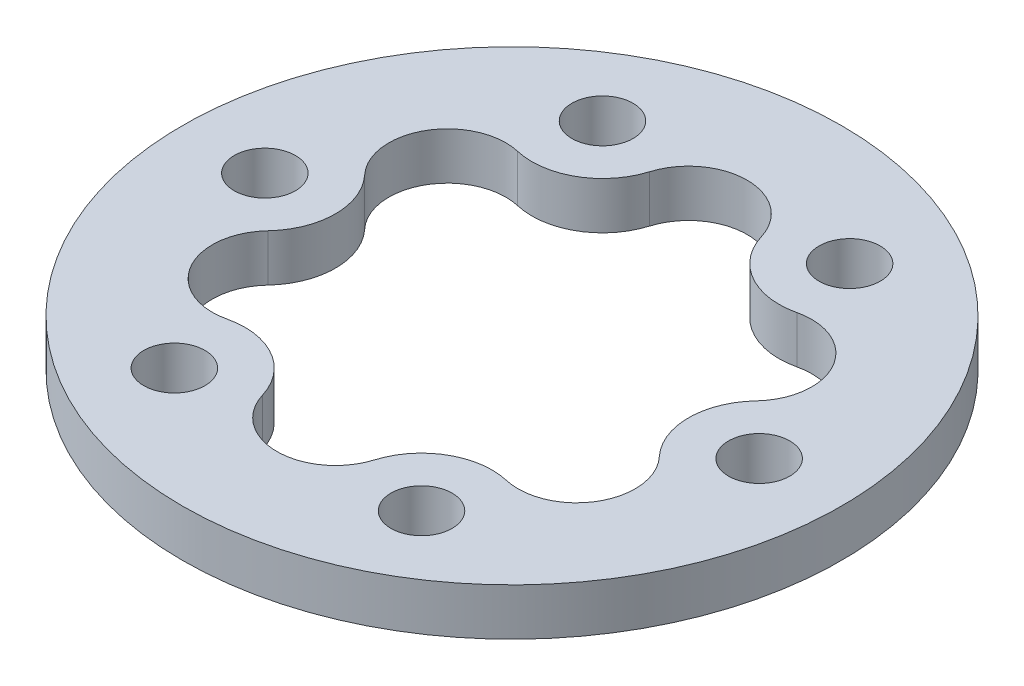
ISO-10303-21;
HEADER;
FILE_DESCRIPTION(('STEP AP214'),'2;1');
FILE_NAME('part.step','',(''),(''),'','','');
FILE_SCHEMA(('AUTOMOTIVE_DESIGN { 1 0 10303 214 1 1 1 1 }'));
ENDSEC;
DATA;
#1=APPLICATION_CONTEXT('core data for automotive mechanical design processes');
#2=APPLICATION_PROTOCOL_DEFINITION('international standard','automotive_design',2000,#1);
#3=PRODUCT_CONTEXT('',#1,'mechanical');
#4=PRODUCT('Part','Part','',(#3));
#5=PRODUCT_RELATED_PRODUCT_CATEGORY('part','',(#4));
#6=PRODUCT_DEFINITION_FORMATION('','',#4);
#7=PRODUCT_DEFINITION_CONTEXT('part definition',#1,'design');
#8=PRODUCT_DEFINITION('design','',#6,#7);
#9=PRODUCT_DEFINITION_SHAPE('','',#8);
#10=(LENGTH_UNIT() NAMED_UNIT(*) SI_UNIT(.MILLI.,.METRE.));
#11=(NAMED_UNIT(*) PLANE_ANGLE_UNIT() SI_UNIT($,.RADIAN.));
#12=(NAMED_UNIT(*) SI_UNIT($,.STERADIAN.) SOLID_ANGLE_UNIT());
#13=UNCERTAINTY_MEASURE_WITH_UNIT(LENGTH_MEASURE(1.E-05),#10,'distance_accuracy_value','');
#14=(GEOMETRIC_REPRESENTATION_CONTEXT(3) GLOBAL_UNCERTAINTY_ASSIGNED_CONTEXT((#13)) GLOBAL_UNIT_ASSIGNED_CONTEXT((#10,
#11,#12)) REPRESENTATION_CONTEXT('',''));
#15=CARTESIAN_POINT('',(0.,0.,0.));
#16=DIRECTION('',(0.,0.,1.));
#17=DIRECTION('',(1.,0.,0.));
#18=AXIS2_PLACEMENT_3D('',#15,#16,#17);
#19=CARTESIAN_POINT('',(0.,4.,0.));
#20=DIRECTION('',(0.,1.,0.));
#21=DIRECTION('',(0.,0.,1.));
#22=AXIS2_PLACEMENT_3D('',#19,#20,#21);
#23=PLANE('',#22);
#24=CARTESIAN_POINT('',(-10.5000000000001,4.,-18.1865334794733));
#25=DIRECTION('',(0.,1.,0.));
#26=DIRECTION('',(0.,0.,1.));
#27=AXIS2_PLACEMENT_3D('',#24,#25,#26);
#28=CIRCLE('',#27,2.6);
#29=CARTESIAN_POINT('',(-10.5000000000001,4.,-15.5865334794733));
#30=VERTEX_POINT('',#29);
#31=EDGE_CURVE('E225',#30,#30,#28,.T.);
#32=ORIENTED_EDGE('',*,*,#31,.F.);
#33=EDGE_LOOP('',(#32));
#34=FACE_BOUND('',#33,.T.);
#35=CARTESIAN_POINT('',(-10.5000000000001,4.,18.1865334794731));
#36=DIRECTION('',(0.,1.,0.));
#37=DIRECTION('',(0.,0.,1.));
#38=AXIS2_PLACEMENT_3D('',#35,#36,#37);
#39=CIRCLE('',#38,2.6);
#40=CARTESIAN_POINT('',(-10.5000000000001,4.,20.7865334794731));
#41=VERTEX_POINT('',#40);
#42=EDGE_CURVE('E237',#41,#41,#39,.T.);
#43=ORIENTED_EDGE('',*,*,#42,.F.);
#44=EDGE_LOOP('',(#43));
#45=FACE_BOUND('',#44,.T.);
#46=CARTESIAN_POINT('',(20.9999999999999,4.,0.));
#47=DIRECTION('',(0.,1.,0.));
#48=DIRECTION('',(0.,0.,1.));
#49=AXIS2_PLACEMENT_3D('',#46,#47,#48);
#50=CIRCLE('',#49,2.6);
#51=CARTESIAN_POINT('',(20.9999999999999,4.,2.59999999999992));
#52=VERTEX_POINT('',#51);
#53=EDGE_CURVE('E249',#52,#52,#50,.T.);
#54=ORIENTED_EDGE('',*,*,#53,.F.);
#55=EDGE_LOOP('',(#54));
#56=FACE_BOUND('',#55,.T.);
#57=CARTESIAN_POINT('',(0.,4.,0.));
#58=DIRECTION('',(0.,1.,0.));
#59=DIRECTION('',(0.,0.,1.));
#60=AXIS2_PLACEMENT_3D('',#57,#58,#59);
#61=CIRCLE('',#60,28.);
#62=CARTESIAN_POINT('',(0.,4.,28.));
#63=VERTEX_POINT('',#62);
#64=EDGE_CURVE('E11',#63,#63,#61,.T.);
#65=ORIENTED_EDGE('',*,*,#64,.T.);
#66=EDGE_LOOP('',(#65));
#67=FACE_BOUND('',#66,.T.);
#68=CARTESIAN_POINT('',(10.4999999999999,4.,-18.1865334794733));
#69=DIRECTION('',(0.,1.,0.));
#70=DIRECTION('',(0.,0.,1.));
#71=AXIS2_PLACEMENT_3D('',#68,#69,#70);
#72=CIRCLE('',#71,2.6);
#73=CARTESIAN_POINT('',(10.4999999999999,4.,-15.5865334794733));
#74=VERTEX_POINT('',#73);
#75=EDGE_CURVE('E255',#74,#74,#72,.T.);
#76=ORIENTED_EDGE('',*,*,#75,.F.);
#77=EDGE_LOOP('',(#76));
#78=FACE_BOUND('',#77,.T.);
#79=CARTESIAN_POINT('',(10.4999999999999,4.,18.1865334794731));
#80=DIRECTION('',(0.,1.,0.));
#81=DIRECTION('',(0.,0.,1.));
#82=AXIS2_PLACEMENT_3D('',#79,#80,#81);
#83=CIRCLE('',#82,2.6);
#84=CARTESIAN_POINT('',(10.4999999999999,4.,20.7865334794731));
#85=VERTEX_POINT('',#84);
#86=EDGE_CURVE('E243',#85,#85,#83,.T.);
#87=ORIENTED_EDGE('',*,*,#86,.F.);
#88=EDGE_LOOP('',(#87));
#89=FACE_BOUND('',#88,.T.);
#90=CARTESIAN_POINT('',(-21.,4.,1.2805208282618E-13));
#91=DIRECTION('',(0.,1.,0.));
#92=DIRECTION('',(0.,0.,1.));
#93=AXIS2_PLACEMENT_3D('',#90,#91,#92);
#94=CIRCLE('',#93,2.6);
#95=CARTESIAN_POINT('',(-21.,4.,2.60000000000013));
#96=VERTEX_POINT('',#95);
#97=EDGE_CURVE('E231',#96,#96,#94,.T.);
#98=ORIENTED_EDGE('',*,*,#97,.F.);
#99=EDGE_LOOP('',(#98));
#100=FACE_BOUND('',#99,.T.);
#101=CARTESIAN_POINT('',(0.,4.,-15.));
#102=DIRECTION('',(0.,1.,0.));
#103=DIRECTION('',(0.,0.,1.));
#104=AXIS2_PLACEMENT_3D('',#101,#102,#103);
#105=CIRCLE('',#104,4.97287544884216);
#106=CARTESIAN_POINT('',(4.75856966173357,4.,-16.444127765859));
#107=VERTEX_POINT('',#106);
#108=CARTESIAN_POINT('',(-4.7585696630104,4.,-16.444127761652));
#109=VERTEX_POINT('',#108);
#110=EDGE_CURVE('E131',#107,#109,#105,.T.);
#111=ORIENTED_EDGE('',*,*,#110,.F.);
#112=CARTESIAN_POINT('',(10.4999999999999,4.,-18.1865334794733));
#113=DIRECTION('',(0.,1.,0.));
#114=DIRECTION('',(0.,0.,1.));
#115=AXIS2_PLACEMENT_3D('',#112,#113,#114);
#116=CIRCLE('',#115,6.00000000000005);
#117=CARTESIAN_POINT('',(11.8617475531622,4.,-12.343106094671));
#118=VERTEX_POINT('',#117);
#119=EDGE_CURVE('E221',#118,#107,#116,.F.);
#120=ORIENTED_EDGE('',*,*,#119,.F.);
#121=CARTESIAN_POINT('',(12.9903810567666,4.,-7.49999999999997));
#122=DIRECTION('',(0.,1.,0.));
#123=DIRECTION('',(0.,0.,1.));
#124=AXIS2_PLACEMENT_3D('',#121,#122,#123);
#125=CIRCLE('',#124,4.97287544884213);
#126=CARTESIAN_POINT('',(16.6203172191777,4.,-4.10102167019017));
#127=VERTEX_POINT('',#126);
#128=EDGE_CURVE('E219',#127,#118,#125,.T.);
#129=ORIENTED_EDGE('',*,*,#128,.F.);
#130=CARTESIAN_POINT('',(21.,4.,0.));
#131=DIRECTION('',(0.,1.,0.));
#132=DIRECTION('',(0.,0.,1.));
#133=AXIS2_PLACEMENT_3D('',#130,#131,#132);
#134=CIRCLE('',#133,6.00000000000013);
#135=CARTESIAN_POINT('',(16.6203172161726,4.,4.10102166698093));
#136=VERTEX_POINT('',#135);
#137=EDGE_CURVE('E217',#136,#127,#134,.F.);
#138=ORIENTED_EDGE('',*,*,#137,.F.);
#139=CARTESIAN_POINT('',(12.9903810567665,4.,7.50000000000006));
#140=DIRECTION('',(0.,1.,0.));
#141=DIRECTION('',(0.,0.,1.));
#142=AXIS2_PLACEMENT_3D('',#139,#140,#141);
#143=CIRCLE('',#142,4.97287544884211);
#144=CARTESIAN_POINT('',(11.861747557444,4.,12.3431060956688));
#145=VERTEX_POINT('',#144);
#146=EDGE_CURVE('E215',#145,#136,#143,.T.);
#147=ORIENTED_EDGE('',*,*,#146,.F.);
#148=CARTESIAN_POINT('',(10.5,4.,18.1865334794732));
#149=DIRECTION('',(0.,1.,0.));
#150=DIRECTION('',(0.,0.,1.));
#151=AXIS2_PLACEMENT_3D('',#148,#149,#150);
#152=CIRCLE('',#151,6.00000000000014);
#153=CARTESIAN_POINT('',(4.75856966301036,4.,16.4441277616519));
#154=VERTEX_POINT('',#153);
#155=EDGE_CURVE('E213',#154,#145,#152,.F.);
#156=ORIENTED_EDGE('',*,*,#155,.F.);
#157=CARTESIAN_POINT('',(-1.04517089427603E-13,4.,15.));
#158=DIRECTION('',(0.,1.,0.));
#159=DIRECTION('',(0.,0.,1.));
#160=AXIS2_PLACEMENT_3D('',#157,#158,#159);
#161=CIRCLE('',#160,4.97287544884212);
#162=CARTESIAN_POINT('',(-4.75856966173378,4.,16.4441277658589));
#163=VERTEX_POINT('',#162);
#164=EDGE_CURVE('E211',#163,#154,#161,.T.);
#165=ORIENTED_EDGE('',*,*,#164,.F.);
#166=CARTESIAN_POINT('',(-10.5,4.,18.1865334794732));
#167=DIRECTION('',(0.,1.,0.));
#168=DIRECTION('',(0.,0.,1.));
#169=AXIS2_PLACEMENT_3D('',#166,#167,#168);
#170=CIRCLE('',#169,6.00000000000005);
#171=CARTESIAN_POINT('',(-11.8617475531624,4.,12.343106094671));
#172=VERTEX_POINT('',#171);
#173=EDGE_CURVE('E209',#172,#163,#170,.F.);
#174=ORIENTED_EDGE('',*,*,#173,.F.);
#175=CARTESIAN_POINT('',(-12.9903810567667,4.,7.49999999999988));
#176=DIRECTION('',(0.,1.,0.));
#177=DIRECTION('',(0.,0.,1.));
#178=AXIS2_PLACEMENT_3D('',#175,#176,#177);
#179=CIRCLE('',#178,4.97287544884216);
#180=CARTESIAN_POINT('',(-16.6203172191779,4.,4.10102167019012));
#181=VERTEX_POINT('',#180);
#182=EDGE_CURVE('E207',#181,#172,#179,.T.);
#183=ORIENTED_EDGE('',*,*,#182,.F.);
#184=CARTESIAN_POINT('',(-21.,4.,0.));
#185=DIRECTION('',(0.,1.,0.));
#186=DIRECTION('',(0.,0.,1.));
#187=AXIS2_PLACEMENT_3D('',#184,#185,#186);
#188=CIRCLE('',#187,5.99999999999996);
#189=CARTESIAN_POINT('',(-16.6203172161729,4.,-4.10102166698107));
#190=VERTEX_POINT('',#189);
#191=EDGE_CURVE('E205',#190,#181,#188,.F.);
#192=ORIENTED_EDGE('',*,*,#191,.F.);
#193=CARTESIAN_POINT('',(-12.9903810567665,4.,-7.50000000000015));
#194=DIRECTION('',(0.,1.,0.));
#195=DIRECTION('',(0.,0.,1.));
#196=AXIS2_PLACEMENT_3D('',#193,#194,#195);
#197=CIRCLE('',#196,4.97287544884218);
#198=CARTESIAN_POINT('',(-11.8617475574442,4.,-12.343106095669));
#199=VERTEX_POINT('',#198);
#200=EDGE_CURVE('E203',#199,#190,#197,.T.);
#201=ORIENTED_EDGE('',*,*,#200,.F.);
#202=CARTESIAN_POINT('',(-10.4999999999999,4.,-18.1865334794733));
#203=DIRECTION('',(0.,1.,0.));
#204=DIRECTION('',(0.,0.,1.));
#205=AXIS2_PLACEMENT_3D('',#202,#203,#204);
#206=CIRCLE('',#205,5.99999999999997);
#207=EDGE_CURVE('E173',#109,#199,#206,.F.);
#208=ORIENTED_EDGE('',*,*,#207,.F.);
#209=EDGE_LOOP('',(#111,#120,#129,#138,#147,#156,#165,#174,#183,#192,#201,#208));
#210=FACE_BOUND('',#209,.T.);
#211=ADVANCED_FACE('F36',(#34,#45,#56,#67,#78,#89,#100,#210),#23,.T.);
#212=CARTESIAN_POINT('',(0.,0.,0.));
#213=DIRECTION('',(0.,1.,0.));
#214=DIRECTION('',(0.,0.,1.));
#215=AXIS2_PLACEMENT_3D('',#212,#213,#214);
#216=PLANE('',#215);
#217=CARTESIAN_POINT('',(0.,0.,0.));
#218=DIRECTION('',(0.,1.,0.));
#219=DIRECTION('',(0.,0.,1.));
#220=AXIS2_PLACEMENT_3D('',#217,#218,#219);
#221=CIRCLE('',#220,28.);
#222=CARTESIAN_POINT('',(0.,0.,28.));
#223=VERTEX_POINT('',#222);
#224=EDGE_CURVE('E40',#223,#223,#221,.T.);
#225=ORIENTED_EDGE('',*,*,#224,.F.);
#226=EDGE_LOOP('',(#225));
#227=FACE_BOUND('',#226,.T.);
#228=CARTESIAN_POINT('',(10.4999999999999,0.,-18.1865334794733));
#229=DIRECTION('',(0.,1.,0.));
#230=DIRECTION('',(0.,0.,1.));
#231=AXIS2_PLACEMENT_3D('',#228,#229,#230);
#232=CIRCLE('',#231,2.6);
#233=CARTESIAN_POINT('',(10.4999999999999,0.,-15.5865334794733));
#234=VERTEX_POINT('',#233);
#235=EDGE_CURVE('E252',#234,#234,#232,.T.);
#236=ORIENTED_EDGE('',*,*,#235,.T.);
#237=EDGE_LOOP('',(#236));
#238=FACE_BOUND('',#237,.T.);
#239=CARTESIAN_POINT('',(20.9999999999999,0.,0.));
#240=DIRECTION('',(0.,1.,0.));
#241=DIRECTION('',(0.,0.,1.));
#242=AXIS2_PLACEMENT_3D('',#239,#240,#241);
#243=CIRCLE('',#242,2.6);
#244=CARTESIAN_POINT('',(20.9999999999999,0.,2.59999999999992));
#245=VERTEX_POINT('',#244);
#246=EDGE_CURVE('E246',#245,#245,#243,.T.);
#247=ORIENTED_EDGE('',*,*,#246,.T.);
#248=EDGE_LOOP('',(#247));
#249=FACE_BOUND('',#248,.T.);
#250=CARTESIAN_POINT('',(10.4999999999999,0.,18.1865334794731));
#251=DIRECTION('',(0.,1.,0.));
#252=DIRECTION('',(0.,0.,1.));
#253=AXIS2_PLACEMENT_3D('',#250,#251,#252);
#254=CIRCLE('',#253,2.6);
#255=CARTESIAN_POINT('',(10.4999999999999,0.,20.7865334794731));
#256=VERTEX_POINT('',#255);
#257=EDGE_CURVE('E240',#256,#256,#254,.T.);
#258=ORIENTED_EDGE('',*,*,#257,.T.);
#259=EDGE_LOOP('',(#258));
#260=FACE_BOUND('',#259,.T.);
#261=CARTESIAN_POINT('',(-10.5000000000001,0.,18.1865334794731));
#262=DIRECTION('',(0.,1.,0.));
#263=DIRECTION('',(0.,0.,1.));
#264=AXIS2_PLACEMENT_3D('',#261,#262,#263);
#265=CIRCLE('',#264,2.6);
#266=CARTESIAN_POINT('',(-10.5000000000001,0.,20.7865334794731));
#267=VERTEX_POINT('',#266);
#268=EDGE_CURVE('E234',#267,#267,#265,.T.);
#269=ORIENTED_EDGE('',*,*,#268,.T.);
#270=EDGE_LOOP('',(#269));
#271=FACE_BOUND('',#270,.T.);
#272=CARTESIAN_POINT('',(-21.,0.,1.2805208282618E-13));
#273=DIRECTION('',(0.,1.,0.));
#274=DIRECTION('',(0.,0.,1.));
#275=AXIS2_PLACEMENT_3D('',#272,#273,#274);
#276=CIRCLE('',#275,2.6);
#277=CARTESIAN_POINT('',(-21.,0.,2.60000000000013));
#278=VERTEX_POINT('',#277);
#279=EDGE_CURVE('E228',#278,#278,#276,.T.);
#280=ORIENTED_EDGE('',*,*,#279,.T.);
#281=EDGE_LOOP('',(#280));
#282=FACE_BOUND('',#281,.T.);
#283=CARTESIAN_POINT('',(-10.5000000000001,0.,-18.1865334794733));
#284=DIRECTION('',(0.,1.,0.));
#285=DIRECTION('',(0.,0.,1.));
#286=AXIS2_PLACEMENT_3D('',#283,#284,#285);
#287=CIRCLE('',#286,2.6);
#288=CARTESIAN_POINT('',(-10.5000000000001,0.,-15.5865334794733));
#289=VERTEX_POINT('',#288);
#290=EDGE_CURVE('E224',#289,#289,#287,.T.);
#291=ORIENTED_EDGE('',*,*,#290,.T.);
#292=EDGE_LOOP('',(#291));
#293=FACE_BOUND('',#292,.T.);
#294=CARTESIAN_POINT('',(10.4999999999999,0.,-18.1865334794733));
#295=DIRECTION('',(0.,-1.,0.));
#296=DIRECTION('',(0.,0.,1.));
#297=AXIS2_PLACEMENT_3D('',#294,#295,#296);
#298=CIRCLE('',#297,6.00000000000005);
#299=CARTESIAN_POINT('',(11.8617475531622,0.,-12.343106094671));
#300=VERTEX_POINT('',#299);
#301=CARTESIAN_POINT('',(4.75856966173357,0.,-16.444127765859));
#302=VERTEX_POINT('',#301);
#303=EDGE_CURVE('E134',#300,#302,#298,.T.);
#304=ORIENTED_EDGE('',*,*,#303,.T.);
#305=CARTESIAN_POINT('',(0.,0.,-15.));
#306=DIRECTION('',(0.,1.,0.));
#307=DIRECTION('',(0.,0.,-1.));
#308=AXIS2_PLACEMENT_3D('',#305,#306,#307);
#309=CIRCLE('',#308,4.97287544884216);
#310=CARTESIAN_POINT('',(-4.7585696630104,0.,-16.444127761652));
#311=VERTEX_POINT('',#310);
#312=EDGE_CURVE('E128',#302,#311,#309,.T.);
#313=ORIENTED_EDGE('',*,*,#312,.T.);
#314=CARTESIAN_POINT('',(-10.4999999999999,0.,-18.1865334794733));
#315=DIRECTION('',(0.,-1.,0.));
#316=DIRECTION('',(0.,0.,1.));
#317=AXIS2_PLACEMENT_3D('',#314,#315,#316);
#318=CIRCLE('',#317,5.99999999999997);
#319=CARTESIAN_POINT('',(-11.8617475574442,0.,-12.343106095669));
#320=VERTEX_POINT('',#319);
#321=EDGE_CURVE('E137',#311,#320,#318,.T.);
#322=ORIENTED_EDGE('',*,*,#321,.T.);
#323=CARTESIAN_POINT('',(-12.9903810567665,0.,-7.50000000000015));
#324=DIRECTION('',(0.,1.,0.));
#325=DIRECTION('',(0.,0.,-1.));
#326=AXIS2_PLACEMENT_3D('',#323,#324,#325);
#327=CIRCLE('',#326,4.97287544884218);
#328=CARTESIAN_POINT('',(-16.6203172161729,0.,-4.10102166698107));
#329=VERTEX_POINT('',#328);
#330=EDGE_CURVE('E59',#320,#329,#327,.T.);
#331=ORIENTED_EDGE('',*,*,#330,.T.);
#332=CARTESIAN_POINT('',(-21.,0.,0.));
#333=DIRECTION('',(0.,-1.,0.));
#334=DIRECTION('',(0.,0.,1.));
#335=AXIS2_PLACEMENT_3D('',#332,#333,#334);
#336=CIRCLE('',#335,5.99999999999996);
#337=CARTESIAN_POINT('',(-16.6203172191779,0.,4.10102167019012));
#338=VERTEX_POINT('',#337);
#339=EDGE_CURVE('E147',#329,#338,#336,.T.);
#340=ORIENTED_EDGE('',*,*,#339,.T.);
#341=CARTESIAN_POINT('',(-12.9903810567667,0.,7.49999999999988));
#342=DIRECTION('',(0.,1.,0.));
#343=DIRECTION('',(0.,0.,-1.));
#344=AXIS2_PLACEMENT_3D('',#341,#342,#343);
#345=CIRCLE('',#344,4.97287544884216);
#346=CARTESIAN_POINT('',(-11.8617475531624,0.,12.343106094671));
#347=VERTEX_POINT('',#346);
#348=EDGE_CURVE('E150',#338,#347,#345,.T.);
#349=ORIENTED_EDGE('',*,*,#348,.T.);
#350=CARTESIAN_POINT('',(-10.5,0.,18.1865334794732));
#351=DIRECTION('',(0.,-1.,0.));
#352=DIRECTION('',(0.,0.,1.));
#353=AXIS2_PLACEMENT_3D('',#350,#351,#352);
#354=CIRCLE('',#353,6.00000000000005);
#355=CARTESIAN_POINT('',(-4.75856966173378,0.,16.4441277658589));
#356=VERTEX_POINT('',#355);
#357=EDGE_CURVE('E153',#347,#356,#354,.T.);
#358=ORIENTED_EDGE('',*,*,#357,.T.);
#359=CARTESIAN_POINT('',(-1.04517089427603E-13,0.,15.));
#360=DIRECTION('',(0.,1.,0.));
#361=DIRECTION('',(0.,0.,-1.));
#362=AXIS2_PLACEMENT_3D('',#359,#360,#361);
#363=CIRCLE('',#362,4.97287544884212);
#364=CARTESIAN_POINT('',(4.75856966301036,0.,16.4441277616519));
#365=VERTEX_POINT('',#364);
#366=EDGE_CURVE('E156',#356,#365,#363,.T.);
#367=ORIENTED_EDGE('',*,*,#366,.T.);
#368=CARTESIAN_POINT('',(10.5,0.,18.1865334794732));
#369=DIRECTION('',(0.,-1.,0.));
#370=DIRECTION('',(0.,0.,1.));
#371=AXIS2_PLACEMENT_3D('',#368,#369,#370);
#372=CIRCLE('',#371,6.00000000000014);
#373=CARTESIAN_POINT('',(11.861747557444,0.,12.3431060956688));
#374=VERTEX_POINT('',#373);
#375=EDGE_CURVE('E159',#365,#374,#372,.T.);
#376=ORIENTED_EDGE('',*,*,#375,.T.);
#377=CARTESIAN_POINT('',(12.9903810567665,0.,7.50000000000006));
#378=DIRECTION('',(0.,1.,0.));
#379=DIRECTION('',(0.,0.,-1.));
#380=AXIS2_PLACEMENT_3D('',#377,#378,#379);
#381=CIRCLE('',#380,4.97287544884211);
#382=CARTESIAN_POINT('',(16.6203172161726,0.,4.10102166698093));
#383=VERTEX_POINT('',#382);
#384=EDGE_CURVE('E162',#374,#383,#381,.T.);
#385=ORIENTED_EDGE('',*,*,#384,.T.);
#386=CARTESIAN_POINT('',(21.,0.,0.));
#387=DIRECTION('',(0.,-1.,0.));
#388=DIRECTION('',(0.,0.,1.));
#389=AXIS2_PLACEMENT_3D('',#386,#387,#388);
#390=CIRCLE('',#389,6.00000000000013);
#391=CARTESIAN_POINT('',(16.6203172191777,0.,-4.10102167019017));
#392=VERTEX_POINT('',#391);
#393=EDGE_CURVE('E165',#383,#392,#390,.T.);
#394=ORIENTED_EDGE('',*,*,#393,.T.);
#395=CARTESIAN_POINT('',(12.9903810567666,0.,-7.49999999999997));
#396=DIRECTION('',(0.,1.,0.));
#397=DIRECTION('',(0.,0.,-1.));
#398=AXIS2_PLACEMENT_3D('',#395,#396,#397);
#399=CIRCLE('',#398,4.97287544884213);
#400=EDGE_CURVE('E168',#392,#300,#399,.T.);
#401=ORIENTED_EDGE('',*,*,#400,.T.);
#402=EDGE_LOOP('',(#304,#313,#322,#331,#340,#349,#358,#367,#376,#385,#394,#401));
#403=FACE_BOUND('',#402,.T.);
#404=ADVANCED_FACE('F141',(#227,#238,#249,#260,#271,#282,#293,#403),#216,.F.);
#405=CARTESIAN_POINT('',(0.,4.,0.));
#406=DIRECTION('',(0.,-1.,0.));
#407=DIRECTION('',(0.,0.,-1.));
#408=AXIS2_PLACEMENT_3D('',#405,#406,#407);
#409=CYLINDRICAL_SURFACE('',#408,28.);
#410=ORIENTED_EDGE('',*,*,#64,.F.);
#411=EDGE_LOOP('',(#410));
#412=FACE_BOUND('',#411,.T.);
#413=ORIENTED_EDGE('',*,*,#224,.T.);
#414=EDGE_LOOP('',(#413));
#415=FACE_BOUND('',#414,.T.);
#416=ADVANCED_FACE('F38',(#412,#415),#409,.T.);
#417=CARTESIAN_POINT('',(10.4999999999999,4.,-18.1865334794733));
#418=DIRECTION('',(0.,-1.,0.));
#419=DIRECTION('',(0.,0.,-1.));
#420=AXIS2_PLACEMENT_3D('',#417,#418,#419);
#421=CYLINDRICAL_SURFACE('',#420,2.6);
#422=ORIENTED_EDGE('',*,*,#75,.T.);
#423=EDGE_LOOP('',(#422));
#424=FACE_BOUND('',#423,.T.);
#425=ORIENTED_EDGE('',*,*,#235,.F.);
#426=EDGE_LOOP('',(#425));
#427=FACE_BOUND('',#426,.T.);
#428=ADVANCED_FACE('F263',(#424,#427),#421,.F.);
#429=CARTESIAN_POINT('',(20.9999999999999,4.,0.));
#430=DIRECTION('',(0.,-1.,0.));
#431=DIRECTION('',(0.,0.,-1.));
#432=AXIS2_PLACEMENT_3D('',#429,#430,#431);
#433=CYLINDRICAL_SURFACE('',#432,2.6);
#434=ORIENTED_EDGE('',*,*,#53,.T.);
#435=EDGE_LOOP('',(#434));
#436=FACE_BOUND('',#435,.T.);
#437=ORIENTED_EDGE('',*,*,#246,.F.);
#438=EDGE_LOOP('',(#437));
#439=FACE_BOUND('',#438,.T.);
#440=ADVANCED_FACE('F265',(#436,#439),#433,.F.);
#441=CARTESIAN_POINT('',(10.4999999999999,4.,18.1865334794731));
#442=DIRECTION('',(0.,-1.,0.));
#443=DIRECTION('',(0.,0.,-1.));
#444=AXIS2_PLACEMENT_3D('',#441,#442,#443);
#445=CYLINDRICAL_SURFACE('',#444,2.6);
#446=ORIENTED_EDGE('',*,*,#86,.T.);
#447=EDGE_LOOP('',(#446));
#448=FACE_BOUND('',#447,.T.);
#449=ORIENTED_EDGE('',*,*,#257,.F.);
#450=EDGE_LOOP('',(#449));
#451=FACE_BOUND('',#450,.T.);
#452=ADVANCED_FACE('F272',(#448,#451),#445,.F.);
#453=CARTESIAN_POINT('',(-10.5000000000001,4.,18.1865334794731));
#454=DIRECTION('',(0.,-1.,0.));
#455=DIRECTION('',(0.,0.,-1.));
#456=AXIS2_PLACEMENT_3D('',#453,#454,#455);
#457=CYLINDRICAL_SURFACE('',#456,2.6);
#458=ORIENTED_EDGE('',*,*,#42,.T.);
#459=EDGE_LOOP('',(#458));
#460=FACE_BOUND('',#459,.T.);
#461=ORIENTED_EDGE('',*,*,#268,.F.);
#462=EDGE_LOOP('',(#461));
#463=FACE_BOUND('',#462,.T.);
#464=ADVANCED_FACE('F368',(#460,#463),#457,.F.);
#465=CARTESIAN_POINT('',(-21.,4.,1.2805208282618E-13));
#466=DIRECTION('',(0.,-1.,0.));
#467=DIRECTION('',(0.,0.,-1.));
#468=AXIS2_PLACEMENT_3D('',#465,#466,#467);
#469=CYLINDRICAL_SURFACE('',#468,2.6);
#470=ORIENTED_EDGE('',*,*,#97,.T.);
#471=EDGE_LOOP('',(#470));
#472=FACE_BOUND('',#471,.T.);
#473=ORIENTED_EDGE('',*,*,#279,.F.);
#474=EDGE_LOOP('',(#473));
#475=FACE_BOUND('',#474,.T.);
#476=ADVANCED_FACE('F364',(#472,#475),#469,.F.);
#477=CARTESIAN_POINT('',(-10.5000000000001,4.,-18.1865334794733));
#478=DIRECTION('',(0.,-1.,0.));
#479=DIRECTION('',(0.,0.,-1.));
#480=AXIS2_PLACEMENT_3D('',#477,#478,#479);
#481=CYLINDRICAL_SURFACE('',#480,2.6);
#482=ORIENTED_EDGE('',*,*,#31,.T.);
#483=EDGE_LOOP('',(#482));
#484=FACE_BOUND('',#483,.T.);
#485=ORIENTED_EDGE('',*,*,#290,.F.);
#486=EDGE_LOOP('',(#485));
#487=FACE_BOUND('',#486,.T.);
#488=ADVANCED_FACE('F341',(#484,#487),#481,.F.);
#489=CARTESIAN_POINT('',(0.,0.,-15.));
#490=DIRECTION('',(0.,1.,0.));
#491=DIRECTION('',(0.,0.,1.));
#492=AXIS2_PLACEMENT_3D('',#489,#490,#491);
#493=CYLINDRICAL_SURFACE('',#492,4.97287544884216);
#494=ORIENTED_EDGE('',*,*,#110,.T.);
#495=DIRECTION('',(0.,1.,0.));
#496=VECTOR('',#495,1.);
#497=CARTESIAN_POINT('',(-4.7585696630104,0.,-16.444127761652));
#498=LINE('',#497,#496);
#499=EDGE_CURVE('E51',#311,#109,#498,.T.);
#500=ORIENTED_EDGE('',*,*,#499,.F.);
#501=ORIENTED_EDGE('',*,*,#312,.F.);
#502=DIRECTION('',(0.,1.,0.));
#503=VECTOR('',#502,1.);
#504=CARTESIAN_POINT('',(4.75856966173357,0.,-16.444127765859));
#505=LINE('',#504,#503);
#506=EDGE_CURVE('E171',#302,#107,#505,.T.);
#507=ORIENTED_EDGE('',*,*,#506,.T.);
#508=EDGE_LOOP('',(#494,#500,#501,#507));
#509=FACE_BOUND('',#508,.T.);
#510=ADVANCED_FACE('F125',(#509),#493,.F.);
#511=CARTESIAN_POINT('',(10.4999999999999,0.,-18.1865334794733));
#512=DIRECTION('',(0.,1.,0.));
#513=DIRECTION('',(0.,0.,1.));
#514=AXIS2_PLACEMENT_3D('',#511,#512,#513);
#515=CYLINDRICAL_SURFACE('',#514,6.00000000000005);
#516=ORIENTED_EDGE('',*,*,#119,.T.);
#517=ORIENTED_EDGE('',*,*,#506,.F.);
#518=ORIENTED_EDGE('',*,*,#303,.F.);
#519=DIRECTION('',(0.,1.,0.));
#520=VECTOR('',#519,1.);
#521=CARTESIAN_POINT('',(11.8617475531622,0.,-12.343106094671));
#522=LINE('',#521,#520);
#523=EDGE_CURVE('E174',#300,#118,#522,.T.);
#524=ORIENTED_EDGE('',*,*,#523,.T.);
#525=EDGE_LOOP('',(#516,#517,#518,#524));
#526=FACE_BOUND('',#525,.T.);
#527=ADVANCED_FACE('F333',(#526),#515,.T.);
#528=CARTESIAN_POINT('',(12.9903810567666,0.,-7.49999999999997));
#529=DIRECTION('',(0.,1.,0.));
#530=DIRECTION('',(0.,0.,1.));
#531=AXIS2_PLACEMENT_3D('',#528,#529,#530);
#532=CYLINDRICAL_SURFACE('',#531,4.97287544884213);
#533=ORIENTED_EDGE('',*,*,#128,.T.);
#534=ORIENTED_EDGE('',*,*,#523,.F.);
#535=ORIENTED_EDGE('',*,*,#400,.F.);
#536=DIRECTION('',(0.,1.,0.));
#537=VECTOR('',#536,1.);
#538=CARTESIAN_POINT('',(16.6203172191777,0.,-4.10102167019017));
#539=LINE('',#538,#537);
#540=EDGE_CURVE('E177',#392,#127,#539,.T.);
#541=ORIENTED_EDGE('',*,*,#540,.T.);
#542=EDGE_LOOP('',(#533,#534,#535,#541));
#543=FACE_BOUND('',#542,.T.);
#544=ADVANCED_FACE('F331',(#543),#532,.F.);
#545=CARTESIAN_POINT('',(21.,0.,0.));
#546=DIRECTION('',(0.,1.,0.));
#547=DIRECTION('',(0.,0.,1.));
#548=AXIS2_PLACEMENT_3D('',#545,#546,#547);
#549=CYLINDRICAL_SURFACE('',#548,6.00000000000013);
#550=ORIENTED_EDGE('',*,*,#137,.T.);
#551=ORIENTED_EDGE('',*,*,#540,.F.);
#552=ORIENTED_EDGE('',*,*,#393,.F.);
#553=DIRECTION('',(0.,1.,0.));
#554=VECTOR('',#553,1.);
#555=CARTESIAN_POINT('',(16.6203172161726,0.,4.10102166698093));
#556=LINE('',#555,#554);
#557=EDGE_CURVE('E180',#383,#136,#556,.T.);
#558=ORIENTED_EDGE('',*,*,#557,.T.);
#559=EDGE_LOOP('',(#550,#551,#552,#558));
#560=FACE_BOUND('',#559,.T.);
#561=ADVANCED_FACE('F328',(#560),#549,.T.);
#562=CARTESIAN_POINT('',(12.9903810567665,0.,7.50000000000006));
#563=DIRECTION('',(0.,1.,0.));
#564=DIRECTION('',(0.,0.,1.));
#565=AXIS2_PLACEMENT_3D('',#562,#563,#564);
#566=CYLINDRICAL_SURFACE('',#565,4.97287544884211);
#567=ORIENTED_EDGE('',*,*,#146,.T.);
#568=ORIENTED_EDGE('',*,*,#557,.F.);
#569=ORIENTED_EDGE('',*,*,#384,.F.);
#570=DIRECTION('',(0.,1.,0.));
#571=VECTOR('',#570,1.);
#572=CARTESIAN_POINT('',(11.861747557444,0.,12.3431060956688));
#573=LINE('',#572,#571);
#574=EDGE_CURVE('E183',#374,#145,#573,.T.);
#575=ORIENTED_EDGE('',*,*,#574,.T.);
#576=EDGE_LOOP('',(#567,#568,#569,#575));
#577=FACE_BOUND('',#576,.T.);
#578=ADVANCED_FACE('F324',(#577),#566,.F.);
#579=CARTESIAN_POINT('',(10.5,0.,18.1865334794732));
#580=DIRECTION('',(0.,1.,0.));
#581=DIRECTION('',(0.,0.,1.));
#582=AXIS2_PLACEMENT_3D('',#579,#580,#581);
#583=CYLINDRICAL_SURFACE('',#582,6.00000000000014);
#584=ORIENTED_EDGE('',*,*,#155,.T.);
#585=ORIENTED_EDGE('',*,*,#574,.F.);
#586=ORIENTED_EDGE('',*,*,#375,.F.);
#587=DIRECTION('',(0.,1.,0.));
#588=VECTOR('',#587,1.);
#589=CARTESIAN_POINT('',(4.75856966301036,0.,16.4441277616519));
#590=LINE('',#589,#588);
#591=EDGE_CURVE('E186',#365,#154,#590,.T.);
#592=ORIENTED_EDGE('',*,*,#591,.T.);
#593=EDGE_LOOP('',(#584,#585,#586,#592));
#594=FACE_BOUND('',#593,.T.);
#595=ADVANCED_FACE('F320',(#594),#583,.T.);
#596=CARTESIAN_POINT('',(-1.04517089427603E-13,0.,15.));
#597=DIRECTION('',(0.,1.,0.));
#598=DIRECTION('',(0.,0.,1.));
#599=AXIS2_PLACEMENT_3D('',#596,#597,#598);
#600=CYLINDRICAL_SURFACE('',#599,4.97287544884212);
#601=ORIENTED_EDGE('',*,*,#164,.T.);
#602=ORIENTED_EDGE('',*,*,#591,.F.);
#603=ORIENTED_EDGE('',*,*,#366,.F.);
#604=DIRECTION('',(0.,1.,0.));
#605=VECTOR('',#604,1.);
#606=CARTESIAN_POINT('',(-4.75856966173378,0.,16.4441277658589));
#607=LINE('',#606,#605);
#608=EDGE_CURVE('E189',#356,#163,#607,.T.);
#609=ORIENTED_EDGE('',*,*,#608,.T.);
#610=EDGE_LOOP('',(#601,#602,#603,#609));
#611=FACE_BOUND('',#610,.T.);
#612=ADVANCED_FACE('F317',(#611),#600,.F.);
#613=CARTESIAN_POINT('',(-10.5,0.,18.1865334794732));
#614=DIRECTION('',(0.,1.,0.));
#615=DIRECTION('',(0.,0.,1.));
#616=AXIS2_PLACEMENT_3D('',#613,#614,#615);
#617=CYLINDRICAL_SURFACE('',#616,6.00000000000005);
#618=ORIENTED_EDGE('',*,*,#173,.T.);
#619=ORIENTED_EDGE('',*,*,#608,.F.);
#620=ORIENTED_EDGE('',*,*,#357,.F.);
#621=DIRECTION('',(0.,1.,0.));
#622=VECTOR('',#621,1.);
#623=CARTESIAN_POINT('',(-11.8617475531624,0.,12.343106094671));
#624=LINE('',#623,#622);
#625=EDGE_CURVE('E192',#347,#172,#624,.T.);
#626=ORIENTED_EDGE('',*,*,#625,.T.);
#627=EDGE_LOOP('',(#618,#619,#620,#626));
#628=FACE_BOUND('',#627,.T.);
#629=ADVANCED_FACE('F313',(#628),#617,.T.);
#630=CARTESIAN_POINT('',(-12.9903810567667,0.,7.49999999999988));
#631=DIRECTION('',(0.,1.,0.));
#632=DIRECTION('',(0.,0.,1.));
#633=AXIS2_PLACEMENT_3D('',#630,#631,#632);
#634=CYLINDRICAL_SURFACE('',#633,4.97287544884216);
#635=ORIENTED_EDGE('',*,*,#182,.T.);
#636=ORIENTED_EDGE('',*,*,#625,.F.);
#637=ORIENTED_EDGE('',*,*,#348,.F.);
#638=DIRECTION('',(0.,1.,0.));
#639=VECTOR('',#638,1.);
#640=CARTESIAN_POINT('',(-16.6203172191779,0.,4.10102167019012));
#641=LINE('',#640,#639);
#642=EDGE_CURVE('E195',#338,#181,#641,.T.);
#643=ORIENTED_EDGE('',*,*,#642,.T.);
#644=EDGE_LOOP('',(#635,#636,#637,#643));
#645=FACE_BOUND('',#644,.T.);
#646=ADVANCED_FACE('F309',(#645),#634,.F.);
#647=CARTESIAN_POINT('',(-21.,0.,0.));
#648=DIRECTION('',(0.,1.,0.));
#649=DIRECTION('',(0.,0.,1.));
#650=AXIS2_PLACEMENT_3D('',#647,#648,#649);
#651=CYLINDRICAL_SURFACE('',#650,5.99999999999996);
#652=ORIENTED_EDGE('',*,*,#191,.T.);
#653=ORIENTED_EDGE('',*,*,#642,.F.);
#654=ORIENTED_EDGE('',*,*,#339,.F.);
#655=DIRECTION('',(0.,1.,0.));
#656=VECTOR('',#655,1.);
#657=CARTESIAN_POINT('',(-16.6203172161729,0.,-4.10102166698107));
#658=LINE('',#657,#656);
#659=EDGE_CURVE('E198',#329,#190,#658,.T.);
#660=ORIENTED_EDGE('',*,*,#659,.T.);
#661=EDGE_LOOP('',(#652,#653,#654,#660));
#662=FACE_BOUND('',#661,.T.);
#663=ADVANCED_FACE('F304',(#662),#651,.T.);
#664=CARTESIAN_POINT('',(-12.9903810567665,0.,-7.50000000000015));
#665=DIRECTION('',(0.,1.,0.));
#666=DIRECTION('',(0.,0.,1.));
#667=AXIS2_PLACEMENT_3D('',#664,#665,#666);
#668=CYLINDRICAL_SURFACE('',#667,4.97287544884218);
#669=ORIENTED_EDGE('',*,*,#200,.T.);
#670=ORIENTED_EDGE('',*,*,#659,.F.);
#671=ORIENTED_EDGE('',*,*,#330,.F.);
#672=DIRECTION('',(0.,1.,0.));
#673=VECTOR('',#672,1.);
#674=CARTESIAN_POINT('',(-11.8617475574442,0.,-12.343106095669));
#675=LINE('',#674,#673);
#676=EDGE_CURVE('E133',#320,#199,#675,.T.);
#677=ORIENTED_EDGE('',*,*,#676,.T.);
#678=EDGE_LOOP('',(#669,#670,#671,#677));
#679=FACE_BOUND('',#678,.T.);
#680=ADVANCED_FACE('F301',(#679),#668,.F.);
#681=CARTESIAN_POINT('',(-10.4999999999999,0.,-18.1865334794733));
#682=DIRECTION('',(0.,1.,0.));
#683=DIRECTION('',(0.,0.,1.));
#684=AXIS2_PLACEMENT_3D('',#681,#682,#683);
#685=CYLINDRICAL_SURFACE('',#684,5.99999999999997);
#686=ORIENTED_EDGE('',*,*,#207,.T.);
#687=ORIENTED_EDGE('',*,*,#676,.F.);
#688=ORIENTED_EDGE('',*,*,#321,.F.);
#689=ORIENTED_EDGE('',*,*,#499,.T.);
#690=EDGE_LOOP('',(#686,#687,#688,#689));
#691=FACE_BOUND('',#690,.T.);
#692=ADVANCED_FACE('F138',(#691),#685,.T.);
#693=CLOSED_SHELL('',(#211,#404,#416,#428,#440,#452,#464,#476,#488,#510,#527,#544,#561,#578,
#595,#612,#629,#646,#663,#680,#692));
#694=MANIFOLD_SOLID_BREP('B2',#693);
#695=ADVANCED_BREP_SHAPE_REPRESENTATION('',(#18,#694),#14);
#696=SHAPE_DEFINITION_REPRESENTATION(#9,#695);
ENDSEC;
END-ISO-10303-21;
